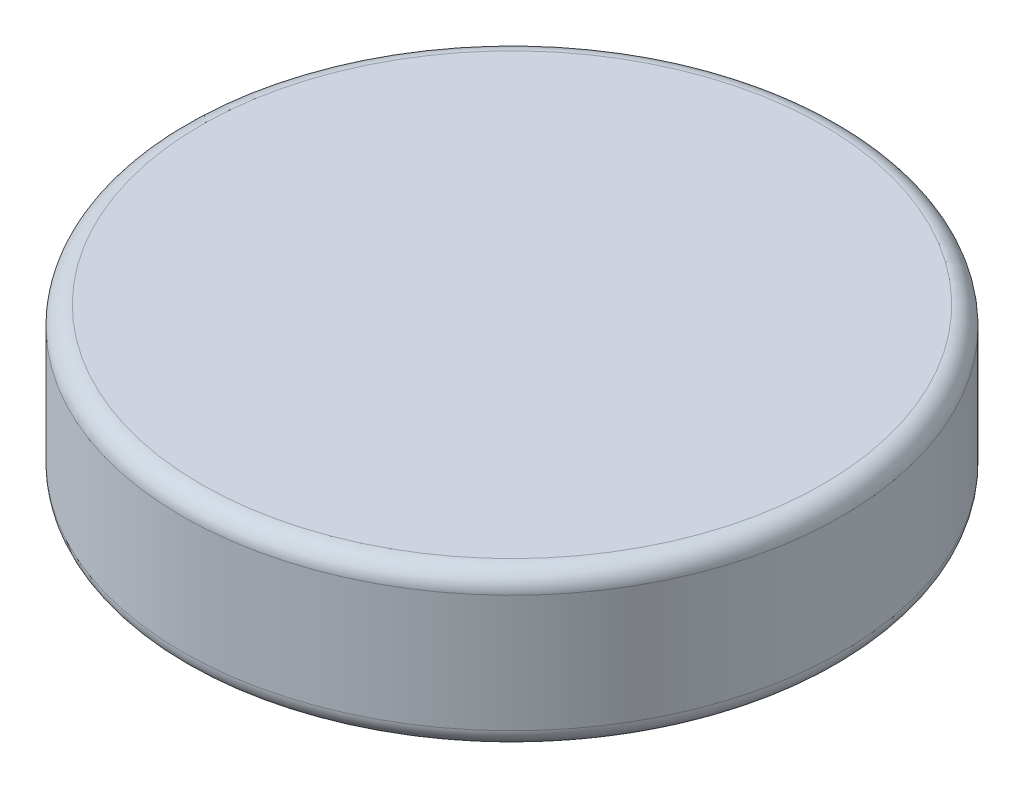
ISO-10303-21;
HEADER;
FILE_DESCRIPTION(('STEP AP214'),'2;1');
FILE_NAME('part.step','',(''),(''),'','','');
FILE_SCHEMA(('AUTOMOTIVE_DESIGN { 1 0 10303 214 1 1 1 1 }'));
ENDSEC;
DATA;
#1=APPLICATION_CONTEXT('core data for automotive mechanical design processes');
#2=APPLICATION_PROTOCOL_DEFINITION('international standard','automotive_design',2000,#1);
#3=PRODUCT_CONTEXT('',#1,'mechanical');
#4=PRODUCT('Part','Part','',(#3));
#5=PRODUCT_RELATED_PRODUCT_CATEGORY('part','',(#4));
#6=PRODUCT_DEFINITION_FORMATION('','',#4);
#7=PRODUCT_DEFINITION_CONTEXT('part definition',#1,'design');
#8=PRODUCT_DEFINITION('design','',#6,#7);
#9=PRODUCT_DEFINITION_SHAPE('','',#8);
#10=(LENGTH_UNIT() NAMED_UNIT(*) SI_UNIT(.MILLI.,.METRE.));
#11=(NAMED_UNIT(*) PLANE_ANGLE_UNIT() SI_UNIT($,.RADIAN.));
#12=(NAMED_UNIT(*) SI_UNIT($,.STERADIAN.) SOLID_ANGLE_UNIT());
#13=UNCERTAINTY_MEASURE_WITH_UNIT(LENGTH_MEASURE(1.E-05),#10,'distance_accuracy_value','');
#14=(GEOMETRIC_REPRESENTATION_CONTEXT(3) GLOBAL_UNCERTAINTY_ASSIGNED_CONTEXT((#13)) GLOBAL_UNIT_ASSIGNED_CONTEXT((#10,
#11,#12)) REPRESENTATION_CONTEXT('',''));
#15=CARTESIAN_POINT('',(0.,0.,0.));
#16=DIRECTION('',(0.,0.,1.));
#17=DIRECTION('',(1.,0.,0.));
#18=AXIS2_PLACEMENT_3D('',#15,#16,#17);
#19=CARTESIAN_POINT('',(0.,83.,0.));
#20=DIRECTION('',(0.,-1.,0.));
#21=DIRECTION('',(0.,0.,-1.));
#22=AXIS2_PLACEMENT_3D('',#19,#20,#21);
#23=CYLINDRICAL_SURFACE('',#22,177.);
#24=CARTESIAN_POINT('',(0.,9.99999999999999,0.));
#25=DIRECTION('',(0.,1.,0.));
#26=DIRECTION('',(0.,0.,1.));
#27=AXIS2_PLACEMENT_3D('',#24,#25,#26);
#28=CIRCLE('',#27,177.);
#29=CARTESIAN_POINT('',(0.,9.99999999999999,177.));
#30=VERTEX_POINT('',#29);
#31=EDGE_CURVE('E55',#30,#30,#28,.T.);
#32=ORIENTED_EDGE('',*,*,#31,.T.);
#33=EDGE_LOOP('',(#32));
#34=FACE_BOUND('',#33,.T.);
#35=CARTESIAN_POINT('',(0.,73.,0.));
#36=DIRECTION('',(0.,1.,0.));
#37=DIRECTION('',(0.,0.,1.));
#38=AXIS2_PLACEMENT_3D('',#35,#36,#37);
#39=CIRCLE('',#38,177.);
#40=CARTESIAN_POINT('',(0.,73.,177.));
#41=VERTEX_POINT('',#40);
#42=EDGE_CURVE('E61',#41,#41,#39,.F.);
#43=ORIENTED_EDGE('',*,*,#42,.T.);
#44=EDGE_LOOP('',(#43));
#45=FACE_BOUND('',#44,.T.);
#46=ADVANCED_FACE('F37',(#34,#45),#23,.T.);
#47=CARTESIAN_POINT('',(0.,83.,0.));
#48=DIRECTION('',(0.,1.,0.));
#49=DIRECTION('',(0.,0.,1.));
#50=AXIS2_PLACEMENT_3D('',#47,#48,#49);
#51=PLANE('',#50);
#52=CARTESIAN_POINT('',(0.,83.,0.));
#53=DIRECTION('',(0.,1.,0.));
#54=DIRECTION('',(0.,0.,1.));
#55=AXIS2_PLACEMENT_3D('',#52,#53,#54);
#56=CIRCLE('',#55,167.);
#57=CARTESIAN_POINT('',(0.,83.,167.));
#58=VERTEX_POINT('',#57);
#59=EDGE_CURVE('E45',#58,#58,#56,.T.);
#60=ORIENTED_EDGE('',*,*,#59,.T.);
#61=EDGE_LOOP('',(#60));
#62=FACE_BOUND('',#61,.T.);
#63=ADVANCED_FACE('F84',(#62),#51,.T.);
#64=CARTESIAN_POINT('',(0.,0.,0.));
#65=DIRECTION('',(0.,1.,0.));
#66=DIRECTION('',(0.,0.,1.));
#67=AXIS2_PLACEMENT_3D('',#64,#65,#66);
#68=PLANE('',#67);
#69=CARTESIAN_POINT('',(0.,0.,0.));
#70=DIRECTION('',(0.,1.,0.));
#71=DIRECTION('',(0.,0.,1.));
#72=AXIS2_PLACEMENT_3D('',#69,#70,#71);
#73=CIRCLE('',#72,143.260231918305);
#74=CARTESIAN_POINT('',(0.,0.,143.260231918305));
#75=VERTEX_POINT('',#74);
#76=EDGE_CURVE('E10',#75,#75,#73,.F.);
#77=ORIENTED_EDGE('',*,*,#76,.F.);
#78=EDGE_LOOP('',(#77));
#79=FACE_BOUND('',#78,.T.);
#80=CARTESIAN_POINT('',(0.,0.,0.));
#81=DIRECTION('',(0.,1.,0.));
#82=DIRECTION('',(0.,0.,1.));
#83=AXIS2_PLACEMENT_3D('',#80,#81,#82);
#84=CIRCLE('',#83,167.);
#85=CARTESIAN_POINT('',(0.,0.,167.));
#86=VERTEX_POINT('',#85);
#87=EDGE_CURVE('E50',#86,#86,#84,.F.);
#88=ORIENTED_EDGE('',*,*,#87,.T.);
#89=EDGE_LOOP('',(#88));
#90=FACE_BOUND('',#89,.T.);
#91=ADVANCED_FACE('F90',(#79,#90),#68,.F.);
#92=CARTESIAN_POINT('',(0.,9.99999999999999,0.));
#93=DIRECTION('',(0.,1.,0.));
#94=DIRECTION('',(0.,0.,1.));
#95=AXIS2_PLACEMENT_3D('',#92,#93,#94);
#96=TOROIDAL_SURFACE('',#95,167.,10.);
#97=ORIENTED_EDGE('',*,*,#87,.F.);
#98=EDGE_LOOP('',(#97));
#99=FACE_BOUND('',#98,.T.);
#100=ORIENTED_EDGE('',*,*,#31,.F.);
#101=EDGE_LOOP('',(#100));
#102=FACE_BOUND('',#101,.T.);
#103=ADVANCED_FACE('F80',(#99,#102),#96,.T.);
#104=CARTESIAN_POINT('',(0.,73.,0.));
#105=DIRECTION('',(0.,1.,0.));
#106=DIRECTION('',(0.,0.,1.));
#107=AXIS2_PLACEMENT_3D('',#104,#105,#106);
#108=TOROIDAL_SURFACE('',#107,167.,10.);
#109=ORIENTED_EDGE('',*,*,#42,.F.);
#110=EDGE_LOOP('',(#109));
#111=FACE_BOUND('',#110,.T.);
#112=ORIENTED_EDGE('',*,*,#59,.F.);
#113=EDGE_LOOP('',(#112));
#114=FACE_BOUND('',#113,.T.);
#115=ADVANCED_FACE('F39',(#111,#114),#108,.T.);
#116=CARTESIAN_POINT('',(0.,-15.,0.));
#117=DIRECTION('',(0.,1.,0.));
#118=DIRECTION('',(0.,0.,1.));
#119=AXIS2_PLACEMENT_3D('',#116,#117,#118);
#120=CYLINDRICAL_SURFACE('',#119,143.260231918305);
#121=CARTESIAN_POINT('',(0.,-15.,0.));
#122=DIRECTION('',(0.,-1.,0.));
#123=DIRECTION('',(0.,0.,-1.));
#124=AXIS2_PLACEMENT_3D('',#121,#122,#123);
#125=CIRCLE('',#124,143.260231918305);
#126=CARTESIAN_POINT('',(0.,-15.,-143.260231918305));
#127=VERTEX_POINT('',#126);
#128=EDGE_CURVE('E65',#127,#127,#125,.T.);
#129=ORIENTED_EDGE('',*,*,#128,.F.);
#130=EDGE_LOOP('',(#129));
#131=FACE_BOUND('',#130,.T.);
#132=ORIENTED_EDGE('',*,*,#76,.T.);
#133=EDGE_LOOP('',(#132));
#134=FACE_BOUND('',#133,.T.);
#135=ADVANCED_FACE('F72',(#131,#134),#120,.T.);
#136=CARTESIAN_POINT('',(0.,-15.,0.));
#137=DIRECTION('',(0.,-1.,0.));
#138=DIRECTION('',(0.,0.,-1.));
#139=AXIS2_PLACEMENT_3D('',#136,#137,#138);
#140=PLANE('',#139);
#141=ORIENTED_EDGE('',*,*,#128,.T.);
#142=EDGE_LOOP('',(#141));
#143=FACE_BOUND('',#142,.T.);
#144=ADVANCED_FACE('F70',(#143),#140,.T.);
#145=CLOSED_SHELL('',(#46,#63,#91,#103,#115,#135,#144));
#146=MANIFOLD_SOLID_BREP('B2',#145);
#147=ADVANCED_BREP_SHAPE_REPRESENTATION('',(#18,#146),#14);
#148=SHAPE_DEFINITION_REPRESENTATION(#9,#147);
ENDSEC;
END-ISO-10303-21;
